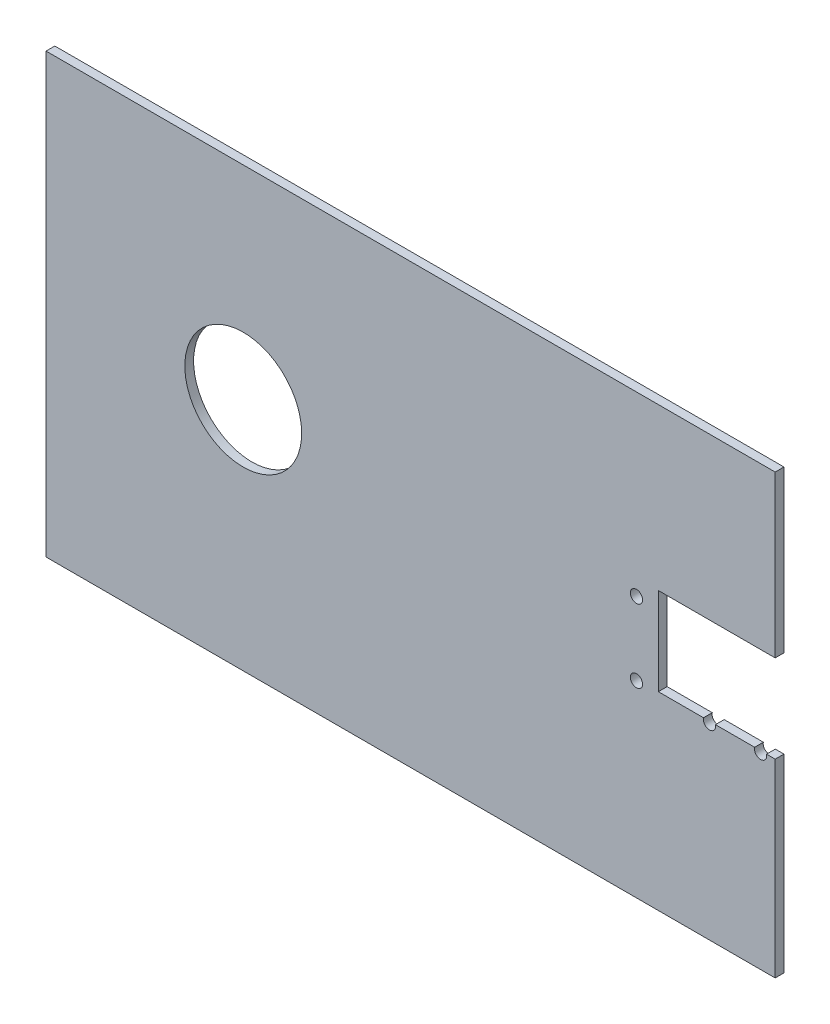
ISO-10303-21;
HEADER;
FILE_DESCRIPTION(('STEP AP214'),'2;1');
FILE_NAME('part.step','',(''),(''),'','','');
FILE_SCHEMA(('AUTOMOTIVE_DESIGN { 1 0 10303 214 1 1 1 1 }'));
ENDSEC;
DATA;
#1=APPLICATION_CONTEXT('core data for automotive mechanical design processes');
#2=APPLICATION_PROTOCOL_DEFINITION('international standard','automotive_design',2000,#1);
#3=PRODUCT_CONTEXT('',#1,'mechanical');
#4=PRODUCT('Part','Part','',(#3));
#5=PRODUCT_RELATED_PRODUCT_CATEGORY('part','',(#4));
#6=PRODUCT_DEFINITION_FORMATION('','',#4);
#7=PRODUCT_DEFINITION_CONTEXT('part definition',#1,'design');
#8=PRODUCT_DEFINITION('design','',#6,#7);
#9=PRODUCT_DEFINITION_SHAPE('','',#8);
#10=(LENGTH_UNIT() NAMED_UNIT(*) SI_UNIT(.MILLI.,.METRE.));
#11=(NAMED_UNIT(*) PLANE_ANGLE_UNIT() SI_UNIT($,.RADIAN.));
#12=(NAMED_UNIT(*) SI_UNIT($,.STERADIAN.) SOLID_ANGLE_UNIT());
#13=UNCERTAINTY_MEASURE_WITH_UNIT(LENGTH_MEASURE(1.E-05),#10,'distance_accuracy_value','');
#14=(GEOMETRIC_REPRESENTATION_CONTEXT(3) GLOBAL_UNCERTAINTY_ASSIGNED_CONTEXT((#13)) GLOBAL_UNIT_ASSIGNED_CONTEXT((#10,
#11,#12)) REPRESENTATION_CONTEXT('',''));
#15=CARTESIAN_POINT('',(0.,0.,0.));
#16=DIRECTION('',(0.,0.,1.));
#17=DIRECTION('',(1.,0.,0.));
#18=AXIS2_PLACEMENT_3D('',#15,#16,#17);
#19=CARTESIAN_POINT('',(209.6,-85.1137115553312,-2.));
#20=DIRECTION('',(0.,-1.,0.));
#21=DIRECTION('',(0.,0.,-1.));
#22=AXIS2_PLACEMENT_3D('',#19,#20,#21);
#23=PLANE('',#22);
#24=DIRECTION('',(1.,0.,0.));
#25=VECTOR('',#24,1.);
#26=CARTESIAN_POINT('',(0.,-85.1137115553312,0.));
#27=LINE('',#26,#25);
#28=CARTESIAN_POINT('',(229.139607805437,-85.1137115553312,0.));
#29=VERTEX_POINT('',#28);
#30=CARTESIAN_POINT('',(242.560392194563,-85.1137115553312,0.));
#31=VERTEX_POINT('',#30);
#32=EDGE_CURVE('E211',#29,#31,#27,.T.);
#33=ORIENTED_EDGE('',*,*,#32,.F.);
#34=DIRECTION('',(0.,0.,1.));
#35=VECTOR('',#34,1.);
#36=CARTESIAN_POINT('',(229.139607805437,-85.1137115553312,0.));
#37=LINE('',#36,#35);
#38=CARTESIAN_POINT('',(229.139607805437,-85.1137115553312,3.));
#39=VERTEX_POINT('',#38);
#40=EDGE_CURVE('E11',#29,#39,#37,.T.);
#41=ORIENTED_EDGE('',*,*,#40,.T.);
#42=DIRECTION('',(1.,0.,0.));
#43=VECTOR('',#42,1.);
#44=CARTESIAN_POINT('',(209.6,-85.1137115553312,3.));
#45=LINE('',#44,#43);
#46=CARTESIAN_POINT('',(242.560392194563,-85.1137115553312,3.));
#47=VERTEX_POINT('',#46);
#48=EDGE_CURVE('E144',#39,#47,#45,.T.);
#49=ORIENTED_EDGE('',*,*,#48,.T.);
#50=DIRECTION('',(0.,0.,1.));
#51=VECTOR('',#50,1.);
#52=CARTESIAN_POINT('',(242.560392194563,-85.1137115553312,0.));
#53=LINE('',#52,#51);
#54=EDGE_CURVE('E124',#47,#31,#53,.F.);
#55=ORIENTED_EDGE('',*,*,#54,.T.);
#56=EDGE_LOOP('',(#33,#41,#49,#55));
#57=FACE_BOUND('',#56,.T.);
#58=ADVANCED_FACE('F33',(#57),#23,.F.);
#59=CARTESIAN_POINT('',(246.639607805437,-85.1137115553312,0.));
#60=VERTEX_POINT('',#59);
#61=CARTESIAN_POINT('',(249.6,-85.1137115553312,0.));
#62=VERTEX_POINT('',#61);
#63=EDGE_CURVE('E136',#60,#62,#27,.T.);
#64=ORIENTED_EDGE('',*,*,#63,.F.);
#65=DIRECTION('',(0.,0.,1.));
#66=VECTOR('',#65,1.);
#67=CARTESIAN_POINT('',(246.639607805437,-85.1137115553312,0.));
#68=LINE('',#67,#66);
#69=CARTESIAN_POINT('',(246.639607805437,-85.1137115553312,3.));
#70=VERTEX_POINT('',#69);
#71=EDGE_CURVE('E123',#60,#70,#68,.T.);
#72=ORIENTED_EDGE('',*,*,#71,.T.);
#73=CARTESIAN_POINT('',(249.6,-85.1137115553312,3.));
#74=VERTEX_POINT('',#73);
#75=EDGE_CURVE('E134',#70,#74,#45,.T.);
#76=ORIENTED_EDGE('',*,*,#75,.T.);
#77=DIRECTION('',(0.,0.,1.));
#78=VECTOR('',#77,1.);
#79=CARTESIAN_POINT('',(249.6,-85.1137115553312,-2.));
#80=LINE('',#79,#78);
#81=EDGE_CURVE('E161',#62,#74,#80,.T.);
#82=ORIENTED_EDGE('',*,*,#81,.F.);
#83=EDGE_LOOP('',(#64,#72,#76,#82));
#84=FACE_BOUND('',#83,.T.);
#85=ADVANCED_FACE('F132',(#84),#23,.F.);
#86=CARTESIAN_POINT('',(249.6,0.,3.));
#87=DIRECTION('',(-1.,0.,0.));
#88=DIRECTION('',(0.,-1.,0.));
#89=AXIS2_PLACEMENT_3D('',#86,#87,#88);
#90=PLANE('',#89);
#91=DIRECTION('',(0.,1.,0.));
#92=VECTOR('',#91,1.);
#93=CARTESIAN_POINT('',(249.6,0.,3.));
#94=LINE('',#93,#92);
#95=CARTESIAN_POINT('',(249.6,-55.1137115553312,3.));
#96=VERTEX_POINT('',#95);
#97=CARTESIAN_POINT('',(249.6,0.,3.));
#98=VERTEX_POINT('',#97);
#99=EDGE_CURVE('E182',#96,#98,#94,.T.);
#100=ORIENTED_EDGE('',*,*,#99,.F.);
#101=DIRECTION('',(0.,0.,1.));
#102=VECTOR('',#101,1.);
#103=CARTESIAN_POINT('',(249.6,-55.1137115553312,-2.));
#104=LINE('',#103,#102);
#105=CARTESIAN_POINT('',(249.6,-55.1137115553312,0.));
#106=VERTEX_POINT('',#105);
#107=EDGE_CURVE('E167',#106,#96,#104,.T.);
#108=ORIENTED_EDGE('',*,*,#107,.F.);
#109=DIRECTION('',(0.,1.,0.));
#110=VECTOR('',#109,1.);
#111=CARTESIAN_POINT('',(249.6,0.,0.));
#112=LINE('',#111,#110);
#113=CARTESIAN_POINT('',(249.6,0.,0.));
#114=VERTEX_POINT('',#113);
#115=EDGE_CURVE('E191',#106,#114,#112,.T.);
#116=ORIENTED_EDGE('',*,*,#115,.T.);
#117=DIRECTION('',(0.,0.,-1.));
#118=VECTOR('',#117,1.);
#119=CARTESIAN_POINT('',(249.6,0.,3.));
#120=LINE('',#119,#118);
#121=EDGE_CURVE('E198',#98,#114,#120,.T.);
#122=ORIENTED_EDGE('',*,*,#121,.F.);
#123=EDGE_LOOP('',(#100,#108,#116,#122));
#124=FACE_BOUND('',#123,.T.);
#125=ADVANCED_FACE('F230',(#124),#90,.F.);
#126=CARTESIAN_POINT('',(0.,0.,3.));
#127=DIRECTION('',(1.,0.,0.));
#128=DIRECTION('',(0.,0.,-1.));
#129=AXIS2_PLACEMENT_3D('',#126,#127,#128);
#130=PLANE('',#129);
#131=DIRECTION('',(0.,-1.,0.));
#132=VECTOR('',#131,1.);
#133=CARTESIAN_POINT('',(0.,0.,0.));
#134=LINE('',#133,#132);
#135=CARTESIAN_POINT('',(0.,0.,0.));
#136=VERTEX_POINT('',#135);
#137=CARTESIAN_POINT('',(0.,-150.,0.));
#138=VERTEX_POINT('',#137);
#139=EDGE_CURVE('E173',#136,#138,#134,.T.);
#140=ORIENTED_EDGE('',*,*,#139,.T.);
#141=DIRECTION('',(0.,0.,-1.));
#142=VECTOR('',#141,1.);
#143=CARTESIAN_POINT('',(0.,-150.,3.));
#144=LINE('',#143,#142);
#145=CARTESIAN_POINT('',(0.,-150.,3.));
#146=VERTEX_POINT('',#145);
#147=EDGE_CURVE('E204',#146,#138,#144,.T.);
#148=ORIENTED_EDGE('',*,*,#147,.F.);
#149=DIRECTION('',(0.,-1.,0.));
#150=VECTOR('',#149,1.);
#151=CARTESIAN_POINT('',(0.,0.,3.));
#152=LINE('',#151,#150);
#153=CARTESIAN_POINT('',(0.,0.,3.));
#154=VERTEX_POINT('',#153);
#155=EDGE_CURVE('E176',#154,#146,#152,.T.);
#156=ORIENTED_EDGE('',*,*,#155,.F.);
#157=DIRECTION('',(0.,0.,-1.));
#158=VECTOR('',#157,1.);
#159=CARTESIAN_POINT('',(0.,0.,3.));
#160=LINE('',#159,#158);
#161=EDGE_CURVE('E186',#154,#136,#160,.T.);
#162=ORIENTED_EDGE('',*,*,#161,.T.);
#163=EDGE_LOOP('',(#140,#148,#156,#162));
#164=FACE_BOUND('',#163,.T.);
#165=ADVANCED_FACE('F35',(#164),#130,.F.);
#166=CARTESIAN_POINT('',(0.,-150.,3.));
#167=DIRECTION('',(0.,1.,0.));
#168=DIRECTION('',(0.,0.,1.));
#169=AXIS2_PLACEMENT_3D('',#166,#167,#168);
#170=PLANE('',#169);
#171=DIRECTION('',(1.,0.,0.));
#172=VECTOR('',#171,1.);
#173=CARTESIAN_POINT('',(0.,-150.,0.));
#174=LINE('',#173,#172);
#175=CARTESIAN_POINT('',(249.6,-150.,0.));
#176=VERTEX_POINT('',#175);
#177=EDGE_CURVE('E189',#138,#176,#174,.T.);
#178=ORIENTED_EDGE('',*,*,#177,.T.);
#179=DIRECTION('',(0.,0.,-1.));
#180=VECTOR('',#179,1.);
#181=CARTESIAN_POINT('',(249.6,-150.,3.));
#182=LINE('',#181,#180);
#183=CARTESIAN_POINT('',(249.6,-150.,3.));
#184=VERTEX_POINT('',#183);
#185=EDGE_CURVE('E201',#184,#176,#182,.T.);
#186=ORIENTED_EDGE('',*,*,#185,.F.);
#187=DIRECTION('',(1.,0.,0.));
#188=VECTOR('',#187,1.);
#189=CARTESIAN_POINT('',(0.,-150.,3.));
#190=LINE('',#189,#188);
#191=EDGE_CURVE('E179',#146,#184,#190,.T.);
#192=ORIENTED_EDGE('',*,*,#191,.F.);
#193=ORIENTED_EDGE('',*,*,#147,.T.);
#194=EDGE_LOOP('',(#178,#186,#192,#193));
#195=FACE_BOUND('',#194,.T.);
#196=ADVANCED_FACE('F314',(#195),#170,.F.);
#197=EDGE_CURVE('E192',#176,#62,#112,.T.);
#198=ORIENTED_EDGE('',*,*,#197,.T.);
#199=ORIENTED_EDGE('',*,*,#81,.T.);
#200=EDGE_CURVE('E143',#184,#74,#94,.T.);
#201=ORIENTED_EDGE('',*,*,#200,.F.);
#202=ORIENTED_EDGE('',*,*,#185,.T.);
#203=EDGE_LOOP('',(#198,#199,#201,#202));
#204=FACE_BOUND('',#203,.T.);
#205=ADVANCED_FACE('F309',(#204),#90,.F.);
#206=CARTESIAN_POINT('',(0.,0.,3.));
#207=DIRECTION('',(0.,-1.,0.));
#208=DIRECTION('',(0.,0.,-1.));
#209=AXIS2_PLACEMENT_3D('',#206,#207,#208);
#210=PLANE('',#209);
#211=DIRECTION('',(-1.,0.,0.));
#212=VECTOR('',#211,1.);
#213=CARTESIAN_POINT('',(0.,0.,0.));
#214=LINE('',#213,#212);
#215=EDGE_CURVE('E180',#114,#136,#214,.T.);
#216=ORIENTED_EDGE('',*,*,#215,.T.);
#217=ORIENTED_EDGE('',*,*,#161,.F.);
#218=DIRECTION('',(-1.,0.,0.));
#219=VECTOR('',#218,1.);
#220=CARTESIAN_POINT('',(0.,0.,3.));
#221=LINE('',#220,#219);
#222=EDGE_CURVE('E184',#98,#154,#221,.T.);
#223=ORIENTED_EDGE('',*,*,#222,.F.);
#224=ORIENTED_EDGE('',*,*,#121,.T.);
#225=EDGE_LOOP('',(#216,#217,#223,#224));
#226=FACE_BOUND('',#225,.T.);
#227=ADVANCED_FACE('F236',(#226),#210,.F.);
#228=CARTESIAN_POINT('',(0.,0.,3.));
#229=DIRECTION('',(0.,0.,1.));
#230=DIRECTION('',(1.,0.,0.));
#231=AXIS2_PLACEMENT_3D('',#228,#229,#230);
#232=PLANE('',#231);
#233=CARTESIAN_POINT('',(202.1,-60.6137115553312,3.));
#234=DIRECTION('',(0.,0.,1.));
#235=DIRECTION('',(1.,0.,0.));
#236=AXIS2_PLACEMENT_3D('',#233,#234,#235);
#237=CIRCLE('',#236,2.09999999999999);
#238=CARTESIAN_POINT('',(204.2,-60.6137115553312,3.));
#239=VERTEX_POINT('',#238);
#240=EDGE_CURVE('E255',#239,#239,#237,.T.);
#241=ORIENTED_EDGE('',*,*,#240,.F.);
#242=EDGE_LOOP('',(#241));
#243=FACE_BOUND('',#242,.T.);
#244=CARTESIAN_POINT('',(202.1,-85.6137115553312,3.));
#245=DIRECTION('',(0.,0.,1.));
#246=DIRECTION('',(1.,0.,0.));
#247=AXIS2_PLACEMENT_3D('',#244,#245,#246);
#248=CIRCLE('',#247,2.09999999999999);
#249=CARTESIAN_POINT('',(204.2,-85.6137115553312,3.));
#250=VERTEX_POINT('',#249);
#251=EDGE_CURVE('E247',#250,#250,#248,.T.);
#252=ORIENTED_EDGE('',*,*,#251,.F.);
#253=EDGE_LOOP('',(#252));
#254=FACE_BOUND('',#253,.T.);
#255=CARTESIAN_POINT('',(227.1,-85.6137115553312,3.));
#256=DIRECTION('',(0.,0.,1.));
#257=DIRECTION('',(1.,0.,0.));
#258=AXIS2_PLACEMENT_3D('',#255,#256,#257);
#259=CIRCLE('',#258,2.10000000000002);
#260=CARTESIAN_POINT('',(225.060392194563,-85.1137115553312,3.));
#261=VERTEX_POINT('',#260);
#262=EDGE_CURVE('E242',#261,#39,#259,.T.);
#263=ORIENTED_EDGE('',*,*,#262,.F.);
#264=CARTESIAN_POINT('',(209.6,-85.1137115553312,3.));
#265=VERTEX_POINT('',#264);
#266=EDGE_CURVE('E147',#265,#261,#45,.T.);
#267=ORIENTED_EDGE('',*,*,#266,.F.);
#268=DIRECTION('',(0.,-1.,0.));
#269=VECTOR('',#268,1.);
#270=CARTESIAN_POINT('',(209.6,-55.1137115553312,3.));
#271=LINE('',#270,#269);
#272=CARTESIAN_POINT('',(209.6,-55.1137115553312,3.));
#273=VERTEX_POINT('',#272);
#274=EDGE_CURVE('E145',#273,#265,#271,.T.);
#275=ORIENTED_EDGE('',*,*,#274,.F.);
#276=DIRECTION('',(-1.,0.,0.));
#277=VECTOR('',#276,1.);
#278=CARTESIAN_POINT('',(209.6,-55.1137115553312,3.));
#279=LINE('',#278,#277);
#280=EDGE_CURVE('E152',#96,#273,#279,.T.);
#281=ORIENTED_EDGE('',*,*,#280,.F.);
#282=ORIENTED_EDGE('',*,*,#99,.T.);
#283=ORIENTED_EDGE('',*,*,#222,.T.);
#284=ORIENTED_EDGE('',*,*,#155,.T.);
#285=ORIENTED_EDGE('',*,*,#191,.T.);
#286=ORIENTED_EDGE('',*,*,#200,.T.);
#287=ORIENTED_EDGE('',*,*,#75,.F.);
#288=CARTESIAN_POINT('',(244.6,-85.6137115553312,3.));
#289=DIRECTION('',(0.,0.,1.));
#290=DIRECTION('',(1.,0.,0.));
#291=AXIS2_PLACEMENT_3D('',#288,#289,#290);
#292=CIRCLE('',#291,2.09999999999999);
#293=EDGE_CURVE('E120',#47,#70,#292,.T.);
#294=ORIENTED_EDGE('',*,*,#293,.F.);
#295=ORIENTED_EDGE('',*,*,#48,.F.);
#296=EDGE_LOOP('',(#263,#267,#275,#281,#282,#283,#284,#285,#286,#287,#294,#295));
#297=FACE_BOUND('',#296,.T.);
#298=CARTESIAN_POINT('',(67.5000000000002,-69.5849433204151,3.));
#299=DIRECTION('',(0.,0.,1.));
#300=DIRECTION('',(1.,0.,0.));
#301=AXIS2_PLACEMENT_3D('',#298,#299,#300);
#302=CIRCLE('',#301,20.);
#303=CARTESIAN_POINT('',(87.5000000000002,-69.5849433204151,3.));
#304=VERTEX_POINT('',#303);
#305=EDGE_CURVE('E166',#304,#304,#302,.T.);
#306=ORIENTED_EDGE('',*,*,#305,.F.);
#307=EDGE_LOOP('',(#306));
#308=FACE_BOUND('',#307,.T.);
#309=ADVANCED_FACE('F140',(#243,#254,#297,#308),#232,.T.);
#310=CARTESIAN_POINT('',(0.,0.,0.));
#311=DIRECTION('',(0.,0.,1.));
#312=DIRECTION('',(1.,0.,0.));
#313=AXIS2_PLACEMENT_3D('',#310,#311,#312);
#314=PLANE('',#313);
#315=CARTESIAN_POINT('',(202.1,-60.6137115553312,0.));
#316=DIRECTION('',(0.,0.,1.));
#317=DIRECTION('',(1.,0.,0.));
#318=AXIS2_PLACEMENT_3D('',#315,#316,#317);
#319=CIRCLE('',#318,2.09999999999999);
#320=CARTESIAN_POINT('',(204.2,-60.6137115553312,0.));
#321=VERTEX_POINT('',#320);
#322=EDGE_CURVE('E252',#321,#321,#319,.T.);
#323=ORIENTED_EDGE('',*,*,#322,.T.);
#324=EDGE_LOOP('',(#323));
#325=FACE_BOUND('',#324,.T.);
#326=CARTESIAN_POINT('',(202.1,-85.6137115553312,0.));
#327=DIRECTION('',(0.,0.,1.));
#328=DIRECTION('',(1.,0.,0.));
#329=AXIS2_PLACEMENT_3D('',#326,#327,#328);
#330=CIRCLE('',#329,2.09999999999999);
#331=CARTESIAN_POINT('',(204.2,-85.6137115553312,0.));
#332=VERTEX_POINT('',#331);
#333=EDGE_CURVE('E243',#332,#332,#330,.T.);
#334=ORIENTED_EDGE('',*,*,#333,.T.);
#335=EDGE_LOOP('',(#334));
#336=FACE_BOUND('',#335,.T.);
#337=CARTESIAN_POINT('',(67.5000000000002,-69.5849433204151,0.));
#338=DIRECTION('',(0.,0.,1.));
#339=DIRECTION('',(1.,0.,0.));
#340=AXIS2_PLACEMENT_3D('',#337,#338,#339);
#341=CIRCLE('',#340,20.);
#342=CARTESIAN_POINT('',(87.5000000000002,-69.5849433204151,0.));
#343=VERTEX_POINT('',#342);
#344=EDGE_CURVE('E170',#343,#343,#341,.T.);
#345=ORIENTED_EDGE('',*,*,#344,.T.);
#346=EDGE_LOOP('',(#345));
#347=FACE_BOUND('',#346,.T.);
#348=CARTESIAN_POINT('',(209.6,-85.1137115553312,0.));
#349=VERTEX_POINT('',#348);
#350=CARTESIAN_POINT('',(225.060392194563,-85.1137115553312,0.));
#351=VERTEX_POINT('',#350);
#352=EDGE_CURVE('E207',#349,#351,#27,.T.);
#353=ORIENTED_EDGE('',*,*,#352,.T.);
#354=CARTESIAN_POINT('',(227.1,-85.6137115553312,0.));
#355=DIRECTION('',(0.,0.,1.));
#356=DIRECTION('',(1.,0.,0.));
#357=AXIS2_PLACEMENT_3D('',#354,#355,#356);
#358=CIRCLE('',#357,2.10000000000002);
#359=EDGE_CURVE('E56',#351,#29,#358,.T.);
#360=ORIENTED_EDGE('',*,*,#359,.T.);
#361=ORIENTED_EDGE('',*,*,#32,.T.);
#362=CARTESIAN_POINT('',(244.6,-85.6137115553312,0.));
#363=DIRECTION('',(0.,0.,1.));
#364=DIRECTION('',(1.,0.,0.));
#365=AXIS2_PLACEMENT_3D('',#362,#363,#364);
#366=CIRCLE('',#365,2.09999999999999);
#367=EDGE_CURVE('E48',#31,#60,#366,.T.);
#368=ORIENTED_EDGE('',*,*,#367,.T.);
#369=ORIENTED_EDGE('',*,*,#63,.T.);
#370=ORIENTED_EDGE('',*,*,#197,.F.);
#371=ORIENTED_EDGE('',*,*,#177,.F.);
#372=ORIENTED_EDGE('',*,*,#139,.F.);
#373=ORIENTED_EDGE('',*,*,#215,.F.);
#374=ORIENTED_EDGE('',*,*,#115,.F.);
#375=DIRECTION('',(-1.,0.,0.));
#376=VECTOR('',#375,1.);
#377=CARTESIAN_POINT('',(0.,-55.1137115553312,0.));
#378=LINE('',#377,#376);
#379=CARTESIAN_POINT('',(209.6,-55.1137115553312,0.));
#380=VERTEX_POINT('',#379);
#381=EDGE_CURVE('E214',#106,#380,#378,.T.);
#382=ORIENTED_EDGE('',*,*,#381,.T.);
#383=DIRECTION('',(0.,-1.,0.));
#384=VECTOR('',#383,1.);
#385=CARTESIAN_POINT('',(209.6,0.,0.));
#386=LINE('',#385,#384);
#387=EDGE_CURVE('E210',#380,#349,#386,.T.);
#388=ORIENTED_EDGE('',*,*,#387,.T.);
#389=EDGE_LOOP('',(#353,#360,#361,#368,#369,#370,#371,#372,#373,#374,#382,#388));
#390=FACE_BOUND('',#389,.T.);
#391=ADVANCED_FACE('F220',(#325,#336,#347,#390),#314,.F.);
#392=CARTESIAN_POINT('',(67.5000000000002,-69.5849433204151,0.));
#393=DIRECTION('',(0.,0.,1.));
#394=DIRECTION('',(1.,0.,0.));
#395=AXIS2_PLACEMENT_3D('',#392,#393,#394);
#396=CYLINDRICAL_SURFACE('',#395,20.);
#397=ORIENTED_EDGE('',*,*,#344,.F.);
#398=EDGE_LOOP('',(#397));
#399=FACE_BOUND('',#398,.T.);
#400=ORIENTED_EDGE('',*,*,#305,.T.);
#401=EDGE_LOOP('',(#400));
#402=FACE_BOUND('',#401,.T.);
#403=ADVANCED_FACE('F287',(#399,#402),#396,.F.);
#404=CARTESIAN_POINT('',(209.6,-55.1137115553312,-2.));
#405=DIRECTION('',(-1.,0.,0.));
#406=DIRECTION('',(0.,0.,1.));
#407=AXIS2_PLACEMENT_3D('',#404,#405,#406);
#408=PLANE('',#407);
#409=DIRECTION('',(0.,0.,1.));
#410=VECTOR('',#409,1.);
#411=CARTESIAN_POINT('',(209.6,-55.1137115553312,-2.));
#412=LINE('',#411,#410);
#413=EDGE_CURVE('E164',#380,#273,#412,.T.);
#414=ORIENTED_EDGE('',*,*,#413,.T.);
#415=ORIENTED_EDGE('',*,*,#274,.T.);
#416=DIRECTION('',(0.,0.,1.));
#417=VECTOR('',#416,1.);
#418=CARTESIAN_POINT('',(209.6,-85.1137115553312,-2.));
#419=LINE('',#418,#417);
#420=EDGE_CURVE('E156',#349,#265,#419,.T.);
#421=ORIENTED_EDGE('',*,*,#420,.F.);
#422=ORIENTED_EDGE('',*,*,#387,.F.);
#423=EDGE_LOOP('',(#414,#415,#421,#422));
#424=FACE_BOUND('',#423,.T.);
#425=ADVANCED_FACE('F225',(#424),#408,.F.);
#426=CARTESIAN_POINT('',(209.6,-55.1137115553312,-2.));
#427=DIRECTION('',(0.,1.,0.));
#428=DIRECTION('',(0.,0.,1.));
#429=AXIS2_PLACEMENT_3D('',#426,#427,#428);
#430=PLANE('',#429);
#431=ORIENTED_EDGE('',*,*,#107,.T.);
#432=ORIENTED_EDGE('',*,*,#280,.T.);
#433=ORIENTED_EDGE('',*,*,#413,.F.);
#434=ORIENTED_EDGE('',*,*,#381,.F.);
#435=EDGE_LOOP('',(#431,#432,#433,#434));
#436=FACE_BOUND('',#435,.T.);
#437=ADVANCED_FACE('F226',(#436),#430,.F.);
#438=ORIENTED_EDGE('',*,*,#266,.T.);
#439=DIRECTION('',(0.,0.,1.));
#440=VECTOR('',#439,1.);
#441=CARTESIAN_POINT('',(225.060392194563,-85.1137115553312,0.));
#442=LINE('',#441,#440);
#443=EDGE_CURVE('E41',#261,#351,#442,.F.);
#444=ORIENTED_EDGE('',*,*,#443,.T.);
#445=ORIENTED_EDGE('',*,*,#352,.F.);
#446=ORIENTED_EDGE('',*,*,#420,.T.);
#447=EDGE_LOOP('',(#438,#444,#445,#446));
#448=FACE_BOUND('',#447,.T.);
#449=ADVANCED_FACE('F217',(#448),#23,.F.);
#450=CARTESIAN_POINT('',(244.6,-85.6137115553312,0.));
#451=DIRECTION('',(0.,0.,1.));
#452=DIRECTION('',(1.,0.,0.));
#453=AXIS2_PLACEMENT_3D('',#450,#451,#452);
#454=CYLINDRICAL_SURFACE('',#453,2.09999999999999);
#455=ORIENTED_EDGE('',*,*,#367,.F.);
#456=ORIENTED_EDGE('',*,*,#54,.F.);
#457=ORIENTED_EDGE('',*,*,#293,.T.);
#458=ORIENTED_EDGE('',*,*,#71,.F.);
#459=EDGE_LOOP('',(#455,#456,#457,#458));
#460=FACE_BOUND('',#459,.T.);
#461=ADVANCED_FACE('F122',(#460),#454,.F.);
#462=CARTESIAN_POINT('',(227.1,-85.6137115553312,0.));
#463=DIRECTION('',(0.,0.,1.));
#464=DIRECTION('',(1.,0.,0.));
#465=AXIS2_PLACEMENT_3D('',#462,#463,#464);
#466=CYLINDRICAL_SURFACE('',#465,2.10000000000002);
#467=ORIENTED_EDGE('',*,*,#359,.F.);
#468=ORIENTED_EDGE('',*,*,#443,.F.);
#469=ORIENTED_EDGE('',*,*,#262,.T.);
#470=ORIENTED_EDGE('',*,*,#40,.F.);
#471=EDGE_LOOP('',(#467,#468,#469,#470));
#472=FACE_BOUND('',#471,.T.);
#473=ADVANCED_FACE('F260',(#472),#466,.F.);
#474=CARTESIAN_POINT('',(202.1,-85.6137115553312,0.));
#475=DIRECTION('',(0.,0.,1.));
#476=DIRECTION('',(1.,0.,0.));
#477=AXIS2_PLACEMENT_3D('',#474,#475,#476);
#478=CYLINDRICAL_SURFACE('',#477,2.09999999999999);
#479=ORIENTED_EDGE('',*,*,#333,.F.);
#480=EDGE_LOOP('',(#479));
#481=FACE_BOUND('',#480,.T.);
#482=ORIENTED_EDGE('',*,*,#251,.T.);
#483=EDGE_LOOP('',(#482));
#484=FACE_BOUND('',#483,.T.);
#485=ADVANCED_FACE('F262',(#481,#484),#478,.F.);
#486=CARTESIAN_POINT('',(202.1,-60.6137115553312,0.));
#487=DIRECTION('',(0.,0.,1.));
#488=DIRECTION('',(1.,0.,0.));
#489=AXIS2_PLACEMENT_3D('',#486,#487,#488);
#490=CYLINDRICAL_SURFACE('',#489,2.09999999999999);
#491=ORIENTED_EDGE('',*,*,#322,.F.);
#492=EDGE_LOOP('',(#491));
#493=FACE_BOUND('',#492,.T.);
#494=ORIENTED_EDGE('',*,*,#240,.T.);
#495=EDGE_LOOP('',(#494));
#496=FACE_BOUND('',#495,.T.);
#497=ADVANCED_FACE('F268',(#493,#496),#490,.F.);
#498=CLOSED_SHELL('',(#58,#85,#125,#165,#196,#205,#227,#309,#391,#403,#425,#437,#449,#461,#473,
#485,#497));
#499=MANIFOLD_SOLID_BREP('B2',#498);
#500=ADVANCED_BREP_SHAPE_REPRESENTATION('',(#18,#499),#14);
#501=SHAPE_DEFINITION_REPRESENTATION(#9,#500);
ENDSEC;
END-ISO-10303-21;
